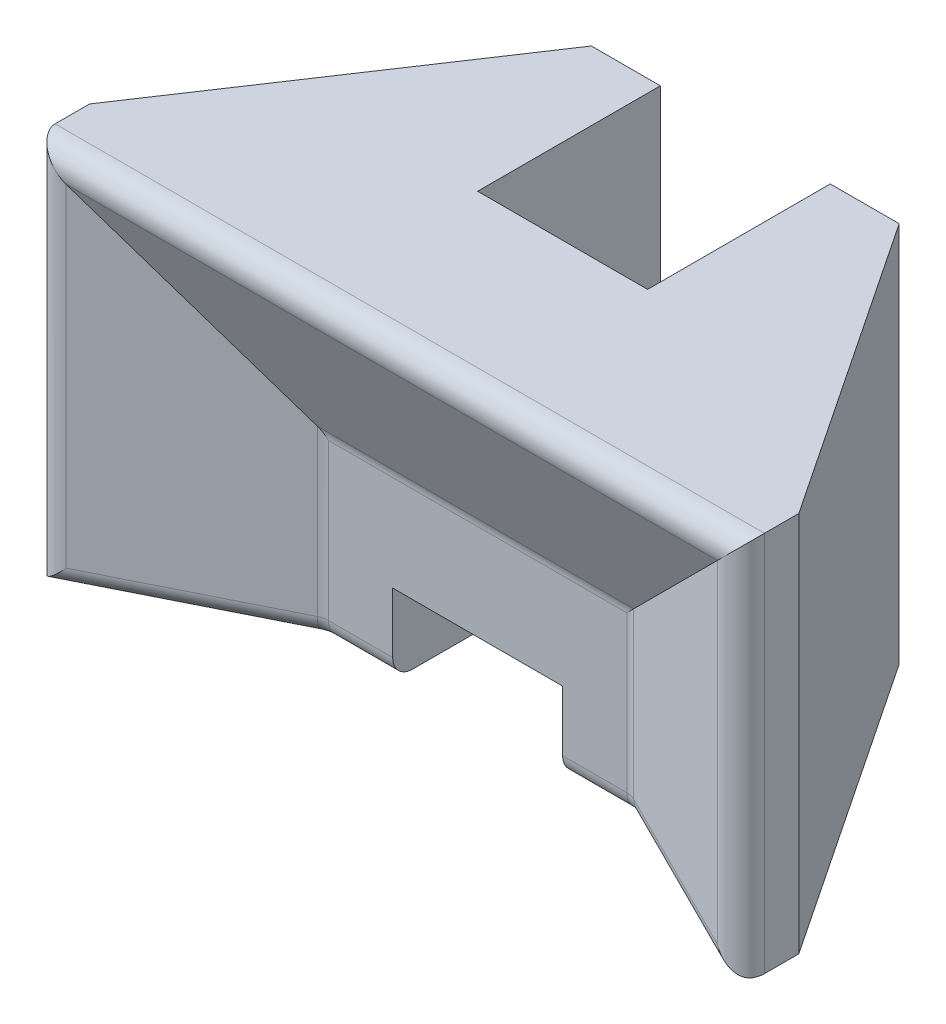
ISO-10303-21;
HEADER;
FILE_DESCRIPTION(('STEP AP214'),'2;1');
FILE_NAME('part.step','',(''),(''),'','','');
FILE_SCHEMA(('AUTOMOTIVE_DESIGN { 1 0 10303 214 1 1 1 1 }'));
ENDSEC;
DATA;
#1=APPLICATION_CONTEXT('core data for automotive mechanical design processes');
#2=APPLICATION_PROTOCOL_DEFINITION('international standard','automotive_design',2000,#1);
#3=PRODUCT_CONTEXT('',#1,'mechanical');
#4=PRODUCT('Part','Part','',(#3));
#5=PRODUCT_RELATED_PRODUCT_CATEGORY('part','',(#4));
#6=PRODUCT_DEFINITION_FORMATION('','',#4);
#7=PRODUCT_DEFINITION_CONTEXT('part definition',#1,'design');
#8=PRODUCT_DEFINITION('design','',#6,#7);
#9=PRODUCT_DEFINITION_SHAPE('','',#8);
#10=(LENGTH_UNIT() NAMED_UNIT(*) SI_UNIT(.MILLI.,.METRE.));
#11=(NAMED_UNIT(*) PLANE_ANGLE_UNIT() SI_UNIT($,.RADIAN.));
#12=(NAMED_UNIT(*) SI_UNIT($,.STERADIAN.) SOLID_ANGLE_UNIT());
#13=UNCERTAINTY_MEASURE_WITH_UNIT(LENGTH_MEASURE(1.E-05),#10,'distance_accuracy_value','');
#14=(GEOMETRIC_REPRESENTATION_CONTEXT(3) GLOBAL_UNCERTAINTY_ASSIGNED_CONTEXT((#13)) GLOBAL_UNIT_ASSIGNED_CONTEXT((#10,
#11,#12)) REPRESENTATION_CONTEXT('',''));
#15=CARTESIAN_POINT('',(0.,0.,0.));
#16=DIRECTION('',(0.,0.,1.));
#17=DIRECTION('',(1.,0.,0.));
#18=AXIS2_PLACEMENT_3D('',#15,#16,#17);
#19=CARTESIAN_POINT('',(-53.,-13.5,15.));
#20=DIRECTION('',(0.,1.,0.));
#21=DIRECTION('',(-1.,0.,0.));
#22=AXIS2_PLACEMENT_3D('',#19,#20,#21);
#23=PLANE('',#22);
#24=CARTESIAN_POINT('',(22.2917960675007,-13.5,3.));
#25=DIRECTION('',(0.,1.,0.));
#26=DIRECTION('',(-1.,0.,0.));
#27=AXIS2_PLACEMENT_3D('',#24,#25,#26);
#28=CIRCLE('',#27,6.);
#29=CARTESIAN_POINT('',(22.2917960675007,-13.5,-3.));
#30=VERTEX_POINT('',#29);
#31=CARTESIAN_POINT('',(24.9750776405004,-13.5,-2.36656314599951));
#32=VERTEX_POINT('',#31);
#33=EDGE_CURVE('E206',#30,#32,#28,.F.);
#34=ORIENTED_EDGE('',*,*,#33,.F.);
#35=DIRECTION('',(-1.,0.,0.));
#36=VECTOR('',#35,1.);
#37=CARTESIAN_POINT('',(-53.,-13.5,-3.));
#38=LINE('',#37,#36);
#39=CARTESIAN_POINT('',(12.7,-13.5,-3.));
#40=VERTEX_POINT('',#39);
#41=EDGE_CURVE('E208',#30,#40,#38,.T.);
#42=ORIENTED_EDGE('',*,*,#41,.T.);
#43=DIRECTION('',(0.,0.,-1.));
#44=VECTOR('',#43,1.);
#45=CARTESIAN_POINT('',(12.7,-13.5,0.));
#46=LINE('',#45,#44);
#47=CARTESIAN_POINT('',(12.7,-13.5,-40.));
#48=VERTEX_POINT('',#47);
#49=EDGE_CURVE('E297',#40,#48,#46,.T.);
#50=ORIENTED_EDGE('',*,*,#49,.T.);
#51=DIRECTION('',(-1.,0.,0.));
#52=VECTOR('',#51,1.);
#53=CARTESIAN_POINT('',(53.,-13.5,-40.));
#54=LINE('',#53,#52);
#55=CARTESIAN_POINT('',(22.9999999999999,-13.5,-40.));
#56=VERTEX_POINT('',#55);
#57=EDGE_CURVE('E336',#56,#48,#54,.T.);
#58=ORIENTED_EDGE('',*,*,#57,.F.);
#59=DIRECTION('',(0.554700196225228,0.,0.832050294337845));
#60=VECTOR('',#59,1.);
#61=CARTESIAN_POINT('',(22.9999999999999,-13.5,-40.));
#62=LINE('',#61,#60);
#63=CARTESIAN_POINT('',(53.,-13.5,5.00000000000026));
#64=VERTEX_POINT('',#63);
#65=EDGE_CURVE('E369',#56,#64,#62,.T.);
#66=ORIENTED_EDGE('',*,*,#65,.T.);
#67=DIRECTION('',(0.,0.,-1.));
#68=VECTOR('',#67,1.);
#69=CARTESIAN_POINT('',(53.,-13.5,15.));
#70=LINE('',#69,#68);
#71=CARTESIAN_POINT('',(53.,-13.5,10.1458980337502));
#72=VERTEX_POINT('',#71);
#73=EDGE_CURVE('E356',#72,#64,#70,.T.);
#74=ORIENTED_EDGE('',*,*,#73,.F.);
#75=CARTESIAN_POINT('',(50.,-13.5,10.1458980337502));
#76=DIRECTION('',(0.,1.,0.));
#77=DIRECTION('',(-1.,0.,0.));
#78=AXIS2_PLACEMENT_3D('',#75,#76,#77);
#79=CIRCLE('',#78,3.);
#80=CARTESIAN_POINT('',(52.6832815729998,-13.5,11.4875388202501));
#81=VERTEX_POINT('',#80);
#82=EDGE_CURVE('E452',#72,#81,#79,.F.);
#83=ORIENTED_EDGE('',*,*,#82,.T.);
#84=DIRECTION('',(0.894427190999917,0.,0.447213595499956));
#85=VECTOR('',#84,1.);
#86=CARTESIAN_POINT('',(24.3416407864999,-13.5,-2.68328157299978));
#87=LINE('',#86,#85);
#88=EDGE_CURVE('E211',#81,#32,#87,.F.);
#89=ORIENTED_EDGE('',*,*,#88,.T.);
#90=EDGE_LOOP('',(#34,#42,#50,#58,#66,#74,#83,#89));
#91=FACE_BOUND('',#90,.T.);
#92=ADVANCED_FACE('F45',(#91),#23,.F.);
#93=CARTESIAN_POINT('',(-53.,43.5,15.));
#94=DIRECTION('',(0.,-1.,0.));
#95=DIRECTION('',(0.,0.,-1.));
#96=AXIS2_PLACEMENT_3D('',#93,#94,#95);
#97=PLANE('',#96);
#98=DIRECTION('',(0.,0.,-1.));
#99=VECTOR('',#98,1.);
#100=CARTESIAN_POINT('',(-53.,43.5,15.));
#101=LINE('',#100,#99);
#102=CARTESIAN_POINT('',(-53.,43.5,10.1458980337502));
#103=VERTEX_POINT('',#102);
#104=CARTESIAN_POINT('',(-53.,43.5,5.00000000000026));
#105=VERTEX_POINT('',#104);
#106=EDGE_CURVE('E349',#103,#105,#101,.T.);
#107=ORIENTED_EDGE('',*,*,#106,.F.);
#108=DIRECTION('',(1.,0.,0.));
#109=VECTOR('',#108,1.);
#110=CARTESIAN_POINT('',(53.,43.5,10.1458980337502));
#111=LINE('',#110,#109);
#112=CARTESIAN_POINT('',(53.,43.5,10.1458980337502));
#113=VERTEX_POINT('',#112);
#114=EDGE_CURVE('E56',#103,#113,#111,.T.);
#115=ORIENTED_EDGE('',*,*,#114,.T.);
#116=DIRECTION('',(0.,0.,-1.));
#117=VECTOR('',#116,1.);
#118=CARTESIAN_POINT('',(53.,43.5,15.));
#119=LINE('',#118,#117);
#120=CARTESIAN_POINT('',(53.,43.5,5.00000000000026));
#121=VERTEX_POINT('',#120);
#122=EDGE_CURVE('E353',#113,#121,#119,.T.);
#123=ORIENTED_EDGE('',*,*,#122,.T.);
#124=DIRECTION('',(-0.554700196225228,0.,-0.832050294337844));
#125=VECTOR('',#124,1.);
#126=CARTESIAN_POINT('',(22.9999999999999,43.5,-40.));
#127=LINE('',#126,#125);
#128=CARTESIAN_POINT('',(22.9999999999999,43.5,-40.));
#129=VERTEX_POINT('',#128);
#130=EDGE_CURVE('E381',#121,#129,#127,.T.);
#131=ORIENTED_EDGE('',*,*,#130,.T.);
#132=DIRECTION('',(1.,0.,0.));
#133=VECTOR('',#132,1.);
#134=CARTESIAN_POINT('',(53.,43.5,-40.));
#135=LINE('',#134,#133);
#136=CARTESIAN_POINT('',(12.7,43.5,-40.));
#137=VERTEX_POINT('',#136);
#138=EDGE_CURVE('E340',#137,#129,#135,.T.);
#139=ORIENTED_EDGE('',*,*,#138,.F.);
#140=DIRECTION('',(0.,0.,-1.));
#141=VECTOR('',#140,1.);
#142=CARTESIAN_POINT('',(12.7,43.5,0.));
#143=LINE('',#142,#141);
#144=CARTESIAN_POINT('',(12.7,43.5,-12.7));
#145=VERTEX_POINT('',#144);
#146=EDGE_CURVE('E271',#145,#137,#143,.T.);
#147=ORIENTED_EDGE('',*,*,#146,.F.);
#148=DIRECTION('',(1.,0.,0.));
#149=VECTOR('',#148,1.);
#150=CARTESIAN_POINT('',(0.,43.5,-12.7));
#151=LINE('',#150,#149);
#152=CARTESIAN_POINT('',(-12.7,43.5,-12.7));
#153=VERTEX_POINT('',#152);
#154=EDGE_CURVE('E278',#153,#145,#151,.T.);
#155=ORIENTED_EDGE('',*,*,#154,.F.);
#156=DIRECTION('',(0.,0.,-1.));
#157=VECTOR('',#156,1.);
#158=CARTESIAN_POINT('',(-12.7,43.5,0.));
#159=LINE('',#158,#157);
#160=CARTESIAN_POINT('',(-12.7,43.5,-40.));
#161=VERTEX_POINT('',#160);
#162=EDGE_CURVE('E287',#153,#161,#159,.T.);
#163=ORIENTED_EDGE('',*,*,#162,.T.);
#164=CARTESIAN_POINT('',(-22.9999999999999,43.5,-40.));
#165=VERTEX_POINT('',#164);
#166=EDGE_CURVE('E341',#165,#161,#135,.T.);
#167=ORIENTED_EDGE('',*,*,#166,.F.);
#168=DIRECTION('',(-0.554700196225228,0.,0.832050294337844));
#169=VECTOR('',#168,1.);
#170=CARTESIAN_POINT('',(-22.9999999999999,43.5,-40.));
#171=LINE('',#170,#169);
#172=EDGE_CURVE('E377',#165,#105,#171,.T.);
#173=ORIENTED_EDGE('',*,*,#172,.T.);
#174=EDGE_LOOP('',(#107,#115,#123,#131,#139,#147,#155,#163,#167,#173));
#175=FACE_BOUND('',#174,.T.);
#176=ADVANCED_FACE('F509',(#175),#97,.F.);
#177=CARTESIAN_POINT('',(0.,0.,-40.));
#178=DIRECTION('',(0.,0.,-1.));
#179=DIRECTION('',(-1.,0.,0.));
#180=AXIS2_PLACEMENT_3D('',#177,#178,#179);
#181=PLANE('',#180);
#182=ORIENTED_EDGE('',*,*,#138,.T.);
#183=DIRECTION('',(0.,-1.,0.));
#184=VECTOR('',#183,1.);
#185=CARTESIAN_POINT('',(22.9999999999999,-13.5,-40.));
#186=LINE('',#185,#184);
#187=EDGE_CURVE('E359',#129,#56,#186,.T.);
#188=ORIENTED_EDGE('',*,*,#187,.T.);
#189=ORIENTED_EDGE('',*,*,#57,.T.);
#190=DIRECTION('',(0.,-1.,0.));
#191=VECTOR('',#190,1.);
#192=CARTESIAN_POINT('',(12.7,43.5,-40.));
#193=LINE('',#192,#191);
#194=EDGE_CURVE('E294',#137,#48,#193,.T.);
#195=ORIENTED_EDGE('',*,*,#194,.F.);
#196=EDGE_LOOP('',(#182,#188,#189,#195));
#197=FACE_BOUND('',#196,.T.);
#198=ADVANCED_FACE('F492',(#197),#181,.T.);
#199=DIRECTION('',(0.,0.,-1.));
#200=VECTOR('',#199,1.);
#201=CARTESIAN_POINT('',(-12.7,-13.5,0.));
#202=LINE('',#201,#200);
#203=CARTESIAN_POINT('',(-12.7,-13.5,-3.));
#204=VERTEX_POINT('',#203);
#205=CARTESIAN_POINT('',(-12.7,-13.5,-40.));
#206=VERTEX_POINT('',#205);
#207=EDGE_CURVE('E92',#204,#206,#202,.T.);
#208=ORIENTED_EDGE('',*,*,#207,.F.);
#209=DIRECTION('',(-1.,0.,0.));
#210=VECTOR('',#209,1.);
#211=CARTESIAN_POINT('',(-53.,-13.5,-3.));
#212=LINE('',#211,#210);
#213=CARTESIAN_POINT('',(-22.2917960675007,-13.5,-3.));
#214=VERTEX_POINT('',#213);
#215=EDGE_CURVE('E446',#204,#214,#212,.T.);
#216=ORIENTED_EDGE('',*,*,#215,.T.);
#217=CARTESIAN_POINT('',(-22.2917960675007,-13.5,3.));
#218=DIRECTION('',(0.,1.,0.));
#219=DIRECTION('',(-1.,0.,0.));
#220=AXIS2_PLACEMENT_3D('',#217,#218,#219);
#221=CIRCLE('',#220,6.);
#222=CARTESIAN_POINT('',(-24.9750776405004,-13.5,-2.3665631459995));
#223=VERTEX_POINT('',#222);
#224=EDGE_CURVE('E442',#223,#214,#221,.F.);
#225=ORIENTED_EDGE('',*,*,#224,.F.);
#226=DIRECTION('',(0.894427190999917,0.,-0.447213595499956));
#227=VECTOR('',#226,1.);
#228=CARTESIAN_POINT('',(-54.3416407864999,-13.5,12.3167184270002));
#229=LINE('',#228,#227);
#230=CARTESIAN_POINT('',(-52.6832815729997,-13.5,11.4875388202501));
#231=VERTEX_POINT('',#230);
#232=EDGE_CURVE('E439',#223,#231,#229,.F.);
#233=ORIENTED_EDGE('',*,*,#232,.T.);
#234=CARTESIAN_POINT('',(-50.,-13.5,10.1458980337502));
#235=DIRECTION('',(0.,1.,0.));
#236=DIRECTION('',(-1.,0.,0.));
#237=AXIS2_PLACEMENT_3D('',#234,#235,#236);
#238=CIRCLE('',#237,3.);
#239=CARTESIAN_POINT('',(-53.,-13.5,10.1458980337502));
#240=VERTEX_POINT('',#239);
#241=EDGE_CURVE('E436',#231,#240,#238,.F.);
#242=ORIENTED_EDGE('',*,*,#241,.T.);
#243=DIRECTION('',(0.,0.,-1.));
#244=VECTOR('',#243,1.);
#245=CARTESIAN_POINT('',(-53.,-13.5,15.));
#246=LINE('',#245,#244);
#247=CARTESIAN_POINT('',(-53.,-13.5,5.00000000000026));
#248=VERTEX_POINT('',#247);
#249=EDGE_CURVE('E346',#240,#248,#246,.T.);
#250=ORIENTED_EDGE('',*,*,#249,.T.);
#251=DIRECTION('',(0.554700196225228,0.,-0.832050294337845));
#252=VECTOR('',#251,1.);
#253=CARTESIAN_POINT('',(-22.9999999999999,-13.5,-40.));
#254=LINE('',#253,#252);
#255=CARTESIAN_POINT('',(-22.9999999999999,-13.5,-40.));
#256=VERTEX_POINT('',#255);
#257=EDGE_CURVE('E392',#248,#256,#254,.T.);
#258=ORIENTED_EDGE('',*,*,#257,.T.);
#259=EDGE_CURVE('E332',#206,#256,#54,.T.);
#260=ORIENTED_EDGE('',*,*,#259,.F.);
#261=EDGE_LOOP('',(#208,#216,#225,#233,#242,#250,#258,#260));
#262=FACE_BOUND('',#261,.T.);
#263=ADVANCED_FACE('F520',(#262),#23,.F.);
#264=CARTESIAN_POINT('',(0.,0.,0.));
#265=DIRECTION('',(0.,0.,-1.));
#266=DIRECTION('',(-1.,0.,0.));
#267=AXIS2_PLACEMENT_3D('',#264,#265,#266);
#268=PLANE('',#267);
#269=DIRECTION('',(0.,-1.,0.));
#270=VECTOR('',#269,1.);
#271=CARTESIAN_POINT('',(-22.2917960675007,0.,0.));
#272=LINE('',#271,#270);
#273=CARTESIAN_POINT('',(-22.2917960675007,12.7917960675007,0.));
#274=VERTEX_POINT('',#273);
#275=CARTESIAN_POINT('',(-22.2917960675007,-10.5,0.));
#276=VERTEX_POINT('',#275);
#277=EDGE_CURVE('E415',#274,#276,#272,.T.);
#278=ORIENTED_EDGE('',*,*,#277,.T.);
#279=DIRECTION('',(-1.,0.,0.));
#280=VECTOR('',#279,1.);
#281=CARTESIAN_POINT('',(0.,-10.5,0.));
#282=LINE('',#281,#280);
#283=CARTESIAN_POINT('',(-12.7,-10.5,0.));
#284=VERTEX_POINT('',#283);
#285=EDGE_CURVE('E418',#276,#284,#282,.F.);
#286=ORIENTED_EDGE('',*,*,#285,.T.);
#287=DIRECTION('',(0.,-1.,0.));
#288=VECTOR('',#287,1.);
#289=CARTESIAN_POINT('',(-12.7,-1.5,0.));
#290=LINE('',#289,#288);
#291=CARTESIAN_POINT('',(-12.7,-1.5,0.));
#292=VERTEX_POINT('',#291);
#293=EDGE_CURVE('E328',#292,#284,#290,.T.);
#294=ORIENTED_EDGE('',*,*,#293,.F.);
#295=DIRECTION('',(-1.,0.,0.));
#296=VECTOR('',#295,1.);
#297=CARTESIAN_POINT('',(0.,-1.5,0.));
#298=LINE('',#297,#296);
#299=CARTESIAN_POINT('',(12.7,-1.5,0.));
#300=VERTEX_POINT('',#299);
#301=EDGE_CURVE('E311',#300,#292,#298,.T.);
#302=ORIENTED_EDGE('',*,*,#301,.F.);
#303=DIRECTION('',(0.,-1.,0.));
#304=VECTOR('',#303,1.);
#305=CARTESIAN_POINT('',(12.7,-1.5,0.));
#306=LINE('',#305,#304);
#307=CARTESIAN_POINT('',(12.7,-10.5,0.));
#308=VERTEX_POINT('',#307);
#309=EDGE_CURVE('E323',#300,#308,#306,.T.);
#310=ORIENTED_EDGE('',*,*,#309,.T.);
#311=DIRECTION('',(-1.,0.,0.));
#312=VECTOR('',#311,1.);
#313=CARTESIAN_POINT('',(0.,-10.5,0.));
#314=LINE('',#313,#312);
#315=CARTESIAN_POINT('',(22.2917960675007,-10.5,0.));
#316=VERTEX_POINT('',#315);
#317=EDGE_CURVE('E405',#308,#316,#314,.F.);
#318=ORIENTED_EDGE('',*,*,#317,.T.);
#319=DIRECTION('',(0.,1.,0.));
#320=VECTOR('',#319,1.);
#321=CARTESIAN_POINT('',(22.2917960675007,0.,0.));
#322=LINE('',#321,#320);
#323=CARTESIAN_POINT('',(22.2917960675007,12.7917960675007,0.));
#324=VERTEX_POINT('',#323);
#325=EDGE_CURVE('E408',#316,#324,#322,.T.);
#326=ORIENTED_EDGE('',*,*,#325,.T.);
#327=DIRECTION('',(-1.,0.,0.));
#328=VECTOR('',#327,1.);
#329=CARTESIAN_POINT('',(0.,12.7917960675007,0.));
#330=LINE('',#329,#328);
#331=EDGE_CURVE('E412',#324,#274,#330,.T.);
#332=ORIENTED_EDGE('',*,*,#331,.T.);
#333=EDGE_LOOP('',(#278,#286,#294,#302,#310,#318,#326,#332));
#334=FACE_BOUND('',#333,.T.);
#335=ADVANCED_FACE('F484',(#334),#268,.F.);
#336=CARTESIAN_POINT('',(53.,-13.5,15.));
#337=DIRECTION('',(-1.,0.,0.));
#338=DIRECTION('',(0.,0.,1.));
#339=AXIS2_PLACEMENT_3D('',#336,#337,#338);
#340=PLANE('',#339);
#341=ORIENTED_EDGE('',*,*,#122,.F.);
#342=DIRECTION('',(0.,-1.,0.));
#343=VECTOR('',#342,1.);
#344=CARTESIAN_POINT('',(53.,-13.5,10.1458980337502));
#345=LINE('',#344,#343);
#346=EDGE_CURVE('E459',#113,#72,#345,.T.);
#347=ORIENTED_EDGE('',*,*,#346,.T.);
#348=ORIENTED_EDGE('',*,*,#73,.T.);
#349=DIRECTION('',(0.,1.,0.));
#350=VECTOR('',#349,1.);
#351=CARTESIAN_POINT('',(53.,43.5,5.00000000000027));
#352=LINE('',#351,#350);
#353=EDGE_CURVE('E373',#64,#121,#352,.T.);
#354=ORIENTED_EDGE('',*,*,#353,.T.);
#355=EDGE_LOOP('',(#341,#347,#348,#354));
#356=FACE_BOUND('',#355,.T.);
#357=ADVANCED_FACE('F510',(#356),#340,.F.);
#358=CARTESIAN_POINT('',(-53.,-13.5,15.));
#359=DIRECTION('',(1.,0.,0.));
#360=DIRECTION('',(0.,0.,-1.));
#361=AXIS2_PLACEMENT_3D('',#358,#359,#360);
#362=PLANE('',#361);
#363=ORIENTED_EDGE('',*,*,#249,.F.);
#364=DIRECTION('',(0.,1.,0.));
#365=VECTOR('',#364,1.);
#366=CARTESIAN_POINT('',(-53.,43.5,10.1458980337502));
#367=LINE('',#366,#365);
#368=EDGE_CURVE('E11',#240,#103,#367,.T.);
#369=ORIENTED_EDGE('',*,*,#368,.T.);
#370=ORIENTED_EDGE('',*,*,#106,.T.);
#371=DIRECTION('',(0.,-1.,0.));
#372=VECTOR('',#371,1.);
#373=CARTESIAN_POINT('',(-53.,-13.5,5.00000000000026));
#374=LINE('',#373,#372);
#375=EDGE_CURVE('E388',#105,#248,#374,.T.);
#376=ORIENTED_EDGE('',*,*,#375,.T.);
#377=EDGE_LOOP('',(#363,#369,#370,#376));
#378=FACE_BOUND('',#377,.T.);
#379=ADVANCED_FACE('F512',(#378),#362,.F.);
#380=CARTESIAN_POINT('',(-53.0000000000002,0.,15.));
#381=DIRECTION('',(-0.447213595499956,0.,-0.894427190999917));
#382=DIRECTION('',(0.,1.,0.));
#383=AXIS2_PLACEMENT_3D('',#380,#381,#382);
#384=PLANE('',#383);
#385=DIRECTION('',(-0.894427190999917,0.,0.447213595499956));
#386=VECTOR('',#385,1.);
#387=CARTESIAN_POINT('',(-23.,-10.5,0.));
#388=LINE('',#387,#386);
#389=CARTESIAN_POINT('',(-48.6583592135001,-10.5,12.82917960675));
#390=VERTEX_POINT('',#389);
#391=CARTESIAN_POINT('',(-23.6334368540006,-10.5,0.316718427000248));
#392=VERTEX_POINT('',#391);
#393=EDGE_CURVE('E430',#390,#392,#388,.F.);
#394=ORIENTED_EDGE('',*,*,#393,.T.);
#395=DIRECTION('',(0.,1.,0.));
#396=VECTOR('',#395,1.);
#397=CARTESIAN_POINT('',(-23.6334368540006,0.,0.31671842700025));
#398=LINE('',#397,#396);
#399=CARTESIAN_POINT('',(-23.6334368540006,14.1334368540006,0.316718427000248));
#400=VERTEX_POINT('',#399);
#401=EDGE_CURVE('E433',#392,#400,#398,.T.);
#402=ORIENTED_EDGE('',*,*,#401,.T.);
#403=DIRECTION('',(-0.666666666666667,0.666666666666667,0.333333333333332));
#404=VECTOR('',#403,1.);
#405=CARTESIAN_POINT('',(-29.4444444444445,19.9444444444445,3.22222222222222));
#406=LINE('',#405,#404);
#407=CARTESIAN_POINT('',(-48.6583592135001,39.1583592135001,12.82917960675));
#408=VERTEX_POINT('',#407);
#409=EDGE_CURVE('E350',#408,#400,#406,.F.);
#410=ORIENTED_EDGE('',*,*,#409,.F.);
#411=DIRECTION('',(0.,-1.,0.));
#412=VECTOR('',#411,1.);
#413=CARTESIAN_POINT('',(-48.6583592135001,-13.5,12.82917960675));
#414=LINE('',#413,#412);
#415=EDGE_CURVE('E427',#408,#390,#414,.T.);
#416=ORIENTED_EDGE('',*,*,#415,.T.);
#417=EDGE_LOOP('',(#394,#402,#410,#416));
#418=FACE_BOUND('',#417,.T.);
#419=ADVANCED_FACE('F518',(#418),#384,.F.);
#420=CARTESIAN_POINT('',(0.,43.5000000000002,15.));
#421=DIRECTION('',(0.,0.447213595499956,-0.894427190999917));
#422=DIRECTION('',(1.,0.,0.));
#423=AXIS2_PLACEMENT_3D('',#420,#421,#422);
#424=PLANE('',#423);
#425=ORIENTED_EDGE('',*,*,#409,.T.);
#426=DIRECTION('',(1.,0.,0.));
#427=VECTOR('',#426,1.);
#428=CARTESIAN_POINT('',(0.,14.1334368540006,0.316718427000248));
#429=LINE('',#428,#427);
#430=CARTESIAN_POINT('',(23.6334368540006,14.1334368540006,0.316718427000251));
#431=VERTEX_POINT('',#430);
#432=EDGE_CURVE('E424',#400,#431,#429,.T.);
#433=ORIENTED_EDGE('',*,*,#432,.T.);
#434=DIRECTION('',(0.666666666666667,0.666666666666667,0.333333333333332));
#435=VECTOR('',#434,1.);
#436=CARTESIAN_POINT('',(33.6666666666668,24.1666666666668,5.33333333333333));
#437=LINE('',#436,#435);
#438=CARTESIAN_POINT('',(48.6583592135001,39.1583592135001,12.82917960675));
#439=VERTEX_POINT('',#438);
#440=EDGE_CURVE('E345',#439,#431,#437,.F.);
#441=ORIENTED_EDGE('',*,*,#440,.F.);
#442=DIRECTION('',(-1.,0.,0.));
#443=VECTOR('',#442,1.);
#444=CARTESIAN_POINT('',(-53.,39.1583592135001,12.82917960675));
#445=LINE('',#444,#443);
#446=EDGE_CURVE('E421',#439,#408,#445,.T.);
#447=ORIENTED_EDGE('',*,*,#446,.T.);
#448=EDGE_LOOP('',(#425,#433,#441,#447));
#449=FACE_BOUND('',#448,.T.);
#450=ADVANCED_FACE('F555',(#449),#424,.F.);
#451=CARTESIAN_POINT('',(53.0000000000002,0.,15.));
#452=DIRECTION('',(0.447213595499956,0.,-0.894427190999917));
#453=DIRECTION('',(0.,-1.,0.));
#454=AXIS2_PLACEMENT_3D('',#451,#452,#453);
#455=PLANE('',#454);
#456=ORIENTED_EDGE('',*,*,#440,.T.);
#457=DIRECTION('',(0.,-1.,0.));
#458=VECTOR('',#457,1.);
#459=CARTESIAN_POINT('',(23.6334368540006,0.,0.316718427000248));
#460=LINE('',#459,#458);
#461=CARTESIAN_POINT('',(23.6334368540006,-10.5,0.316718427000247));
#462=VERTEX_POINT('',#461);
#463=EDGE_CURVE('E401',#431,#462,#460,.T.);
#464=ORIENTED_EDGE('',*,*,#463,.T.);
#465=DIRECTION('',(-0.894427190999917,0.,-0.447213595499956));
#466=VECTOR('',#465,1.);
#467=CARTESIAN_POINT('',(53.0000000000001,-10.5,14.9999999999999));
#468=LINE('',#467,#466);
#469=CARTESIAN_POINT('',(48.6583592135001,-10.5,12.82917960675));
#470=VERTEX_POINT('',#469);
#471=EDGE_CURVE('E398',#462,#470,#468,.F.);
#472=ORIENTED_EDGE('',*,*,#471,.T.);
#473=DIRECTION('',(0.,1.,0.));
#474=VECTOR('',#473,1.);
#475=CARTESIAN_POINT('',(48.6583592135001,43.5,12.82917960675));
#476=LINE('',#475,#474);
#477=EDGE_CURVE('E395',#470,#439,#476,.T.);
#478=ORIENTED_EDGE('',*,*,#477,.T.);
#479=EDGE_LOOP('',(#456,#464,#472,#478));
#480=FACE_BOUND('',#479,.T.);
#481=ADVANCED_FACE('F473',(#480),#455,.F.);
#482=ORIENTED_EDGE('',*,*,#259,.T.);
#483=DIRECTION('',(0.,1.,0.));
#484=VECTOR('',#483,1.);
#485=CARTESIAN_POINT('',(-22.9999999999999,43.5,-40.));
#486=LINE('',#485,#484);
#487=EDGE_CURVE('E384',#256,#165,#486,.T.);
#488=ORIENTED_EDGE('',*,*,#487,.T.);
#489=ORIENTED_EDGE('',*,*,#166,.T.);
#490=DIRECTION('',(0.,-1.,0.));
#491=VECTOR('',#490,1.);
#492=CARTESIAN_POINT('',(-12.7,43.5,-40.));
#493=LINE('',#492,#491);
#494=EDGE_CURVE('E298',#161,#206,#493,.T.);
#495=ORIENTED_EDGE('',*,*,#494,.T.);
#496=EDGE_LOOP('',(#482,#488,#489,#495));
#497=FACE_BOUND('',#496,.T.);
#498=ADVANCED_FACE('F535',(#497),#181,.T.);
#499=CARTESIAN_POINT('',(12.7,-1.5,0.));
#500=DIRECTION('',(-1.,0.,0.));
#501=DIRECTION('',(0.,0.,1.));
#502=AXIS2_PLACEMENT_3D('',#499,#500,#501);
#503=PLANE('',#502);
#504=ORIENTED_EDGE('',*,*,#49,.F.);
#505=CARTESIAN_POINT('',(12.7,-10.5,-3.));
#506=DIRECTION('',(-1.,0.,0.));
#507=DIRECTION('',(0.,0.,1.));
#508=AXIS2_PLACEMENT_3D('',#505,#506,#507);
#509=CIRCLE('',#508,3.);
#510=EDGE_CURVE('E225',#40,#308,#509,.T.);
#511=ORIENTED_EDGE('',*,*,#510,.T.);
#512=ORIENTED_EDGE('',*,*,#309,.F.);
#513=DIRECTION('',(0.,0.,-1.));
#514=VECTOR('',#513,1.);
#515=CARTESIAN_POINT('',(12.7,-1.5,0.));
#516=LINE('',#515,#514);
#517=CARTESIAN_POINT('',(12.7,-1.5,-12.7));
#518=VERTEX_POINT('',#517);
#519=EDGE_CURVE('E307',#300,#518,#516,.T.);
#520=ORIENTED_EDGE('',*,*,#519,.T.);
#521=DIRECTION('',(0.,-1.,0.));
#522=VECTOR('',#521,1.);
#523=CARTESIAN_POINT('',(12.7,43.5,-12.7));
#524=LINE('',#523,#522);
#525=EDGE_CURVE('E293',#145,#518,#524,.T.);
#526=ORIENTED_EDGE('',*,*,#525,.F.);
#527=ORIENTED_EDGE('',*,*,#146,.T.);
#528=ORIENTED_EDGE('',*,*,#194,.T.);
#529=EDGE_LOOP('',(#504,#511,#512,#520,#526,#527,#528));
#530=FACE_BOUND('',#529,.T.);
#531=ADVANCED_FACE('F488',(#530),#503,.T.);
#532=CARTESIAN_POINT('',(-12.7,-1.5,0.));
#533=DIRECTION('',(-1.,0.,0.));
#534=DIRECTION('',(0.,0.,1.));
#535=AXIS2_PLACEMENT_3D('',#532,#533,#534);
#536=PLANE('',#535);
#537=ORIENTED_EDGE('',*,*,#293,.T.);
#538=CARTESIAN_POINT('',(-12.7,-10.5,-3.));
#539=DIRECTION('',(-1.,0.,0.));
#540=DIRECTION('',(0.,0.,1.));
#541=AXIS2_PLACEMENT_3D('',#538,#539,#540);
#542=CIRCLE('',#541,3.);
#543=EDGE_CURVE('E449',#284,#204,#542,.F.);
#544=ORIENTED_EDGE('',*,*,#543,.T.);
#545=ORIENTED_EDGE('',*,*,#207,.T.);
#546=ORIENTED_EDGE('',*,*,#494,.F.);
#547=ORIENTED_EDGE('',*,*,#162,.F.);
#548=DIRECTION('',(0.,-1.,0.));
#549=VECTOR('',#548,1.);
#550=CARTESIAN_POINT('',(-12.7,43.5,-12.7));
#551=LINE('',#550,#549);
#552=CARTESIAN_POINT('',(-12.7,-1.5,-12.7));
#553=VERTEX_POINT('',#552);
#554=EDGE_CURVE('E301',#153,#553,#551,.T.);
#555=ORIENTED_EDGE('',*,*,#554,.T.);
#556=DIRECTION('',(0.,0.,-1.));
#557=VECTOR('',#556,1.);
#558=CARTESIAN_POINT('',(-12.7,-1.5,0.));
#559=LINE('',#558,#557);
#560=EDGE_CURVE('E315',#292,#553,#559,.T.);
#561=ORIENTED_EDGE('',*,*,#560,.F.);
#562=EDGE_LOOP('',(#537,#544,#545,#546,#547,#555,#561));
#563=FACE_BOUND('',#562,.T.);
#564=ADVANCED_FACE('F618',(#563),#536,.F.);
#565=CARTESIAN_POINT('',(0.,-1.5,0.));
#566=DIRECTION('',(0.,-1.,0.));
#567=DIRECTION('',(0.,0.,-1.));
#568=AXIS2_PLACEMENT_3D('',#565,#566,#567);
#569=PLANE('',#568);
#570=ORIENTED_EDGE('',*,*,#519,.F.);
#571=ORIENTED_EDGE('',*,*,#301,.T.);
#572=ORIENTED_EDGE('',*,*,#560,.T.);
#573=DIRECTION('',(1.,0.,0.));
#574=VECTOR('',#573,1.);
#575=CARTESIAN_POINT('',(0.,-1.5,-12.7));
#576=LINE('',#575,#574);
#577=EDGE_CURVE('E319',#553,#518,#576,.T.);
#578=ORIENTED_EDGE('',*,*,#577,.T.);
#579=EDGE_LOOP('',(#570,#571,#572,#578));
#580=FACE_BOUND('',#579,.T.);
#581=ADVANCED_FACE('F626',(#580),#569,.T.);
#582=CARTESIAN_POINT('',(0.,43.5,-12.7));
#583=DIRECTION('',(0.,0.,-1.));
#584=DIRECTION('',(-1.,0.,0.));
#585=AXIS2_PLACEMENT_3D('',#582,#583,#584);
#586=PLANE('',#585);
#587=ORIENTED_EDGE('',*,*,#554,.F.);
#588=ORIENTED_EDGE('',*,*,#154,.T.);
#589=ORIENTED_EDGE('',*,*,#525,.T.);
#590=ORIENTED_EDGE('',*,*,#577,.F.);
#591=EDGE_LOOP('',(#587,#588,#589,#590));
#592=FACE_BOUND('',#591,.T.);
#593=ADVANCED_FACE('F578',(#592),#586,.T.);
#594=CARTESIAN_POINT('',(22.9999999999999,0.,-40.));
#595=DIRECTION('',(0.832050294337844,0.,-0.554700196225228));
#596=DIRECTION('',(0.,1.,0.));
#597=AXIS2_PLACEMENT_3D('',#594,#595,#596);
#598=PLANE('',#597);
#599=ORIENTED_EDGE('',*,*,#130,.F.);
#600=ORIENTED_EDGE('',*,*,#353,.F.);
#601=ORIENTED_EDGE('',*,*,#65,.F.);
#602=ORIENTED_EDGE('',*,*,#187,.F.);
#603=EDGE_LOOP('',(#599,#600,#601,#602));
#604=FACE_BOUND('',#603,.T.);
#605=ADVANCED_FACE('F497',(#604),#598,.T.);
#606=CARTESIAN_POINT('',(-22.9999999999999,0.,-40.));
#607=DIRECTION('',(-0.832050294337844,0.,-0.554700196225228));
#608=DIRECTION('',(0.,-1.,0.));
#609=AXIS2_PLACEMENT_3D('',#606,#607,#608);
#610=PLANE('',#609);
#611=ORIENTED_EDGE('',*,*,#257,.F.);
#612=ORIENTED_EDGE('',*,*,#375,.F.);
#613=ORIENTED_EDGE('',*,*,#172,.F.);
#614=ORIENTED_EDGE('',*,*,#487,.F.);
#615=EDGE_LOOP('',(#611,#612,#613,#614));
#616=FACE_BOUND('',#615,.T.);
#617=ADVANCED_FACE('F577',(#616),#610,.T.);
#618=CARTESIAN_POINT('',(-50.,0.,10.1458980337502));
#619=DIRECTION('',(0.,-1.,0.));
#620=DIRECTION('',(0.,0.,-1.));
#621=AXIS2_PLACEMENT_3D('',#618,#619,#620);
#622=CYLINDRICAL_SURFACE('',#621,3.);
#623=ORIENTED_EDGE('',*,*,#368,.F.);
#624=ORIENTED_EDGE('',*,*,#241,.F.);
#625=CARTESIAN_POINT('',(-50.,-10.5,10.1458980337502));
#626=DIRECTION('',(0.632455532033677,-0.707106781186547,-0.316227766016837));
#627=DIRECTION('',(-0.632455532033677,-0.707106781186547,0.316227766016837));
#628=AXIS2_PLACEMENT_3D('',#625,#626,#627);
#629=ELLIPSE('',#628,4.24264068711928,3.);
#630=EDGE_CURVE('E49',#390,#231,#629,.T.);
#631=ORIENTED_EDGE('',*,*,#630,.F.);
#632=ORIENTED_EDGE('',*,*,#415,.F.);
#633=CARTESIAN_POINT('',(-50.,40.5,10.1458980337502));
#634=DIRECTION('',(-0.707106781186547,-0.707106781186547,0.));
#635=DIRECTION('',(-0.707106781186547,0.707106781186547,0.));
#636=AXIS2_PLACEMENT_3D('',#633,#634,#635);
#637=ELLIPSE('',#636,4.24264068711928,3.);
#638=CARTESIAN_POINT('',(-50.,40.5,13.1458980337502));
#639=VERTEX_POINT('',#638);
#640=EDGE_CURVE('E83',#639,#408,#637,.F.);
#641=ORIENTED_EDGE('',*,*,#640,.F.);
#642=CARTESIAN_POINT('',(-50.,40.5,10.1458980337502));
#643=DIRECTION('',(-0.707106781186547,-0.707106781186547,0.));
#644=DIRECTION('',(0.707106781186547,-0.707106781186547,0.));
#645=AXIS2_PLACEMENT_3D('',#642,#643,#644);
#646=ELLIPSE('',#645,4.24264068711928,3.);
#647=EDGE_CURVE('E266',#103,#639,#646,.F.);
#648=ORIENTED_EDGE('',*,*,#647,.F.);
#649=EDGE_LOOP('',(#623,#624,#631,#632,#641,#648));
#650=FACE_BOUND('',#649,.T.);
#651=ADVANCED_FACE('F47',(#650),#622,.T.);
#652=CARTESIAN_POINT('',(-53.,-10.5,-3.));
#653=DIRECTION('',(-1.,0.,0.));
#654=DIRECTION('',(0.,-1.,0.));
#655=AXIS2_PLACEMENT_3D('',#652,#653,#654);
#656=CYLINDRICAL_SURFACE('',#655,3.);
#657=ORIENTED_EDGE('',*,*,#543,.F.);
#658=ORIENTED_EDGE('',*,*,#285,.F.);
#659=CARTESIAN_POINT('',(-22.2917960675007,-10.5,-3.));
#660=DIRECTION('',(-1.,0.,0.));
#661=DIRECTION('',(0.,0.,1.));
#662=AXIS2_PLACEMENT_3D('',#659,#660,#661);
#663=CIRCLE('',#662,3.);
#664=EDGE_CURVE('E262',#214,#276,#663,.T.);
#665=ORIENTED_EDGE('',*,*,#664,.F.);
#666=ORIENTED_EDGE('',*,*,#215,.F.);
#667=EDGE_LOOP('',(#657,#658,#665,#666));
#668=FACE_BOUND('',#667,.T.);
#669=ADVANCED_FACE('F542',(#668),#656,.T.);
#670=CARTESIAN_POINT('',(-54.3416407864999,-10.5,12.3167184270002));
#671=DIRECTION('',(-0.894427190999917,0.,0.447213595499956));
#672=DIRECTION('',(0.447213595499956,0.,0.894427190999917));
#673=AXIS2_PLACEMENT_3D('',#670,#671,#672);
#674=CYLINDRICAL_SURFACE('',#673,3.);
#675=ORIENTED_EDGE('',*,*,#630,.T.);
#676=ORIENTED_EDGE('',*,*,#232,.F.);
#677=CARTESIAN_POINT('',(-24.9750776405004,-10.5,-2.3665631459995));
#678=DIRECTION('',(0.894427190999917,0.,-0.447213595499957));
#679=DIRECTION('',(-0.447213595499957,0.,-0.894427190999917));
#680=AXIS2_PLACEMENT_3D('',#677,#678,#679);
#681=CIRCLE('',#680,3.);
#682=EDGE_CURVE('E258',#392,#223,#681,.T.);
#683=ORIENTED_EDGE('',*,*,#682,.F.);
#684=ORIENTED_EDGE('',*,*,#393,.F.);
#685=EDGE_LOOP('',(#675,#676,#683,#684));
#686=FACE_BOUND('',#685,.T.);
#687=ADVANCED_FACE('F549',(#686),#674,.T.);
#688=CARTESIAN_POINT('',(0.,40.5,10.1458980337502));
#689=DIRECTION('',(-1.,0.,0.));
#690=DIRECTION('',(0.,0.,1.));
#691=AXIS2_PLACEMENT_3D('',#688,#689,#690);
#692=CYLINDRICAL_SURFACE('',#691,3.);
#693=ORIENTED_EDGE('',*,*,#640,.T.);
#694=ORIENTED_EDGE('',*,*,#446,.F.);
#695=CARTESIAN_POINT('',(50.,40.5,10.1458980337502));
#696=DIRECTION('',(-0.707106781186547,0.707106781186547,0.));
#697=DIRECTION('',(0.707106781186547,0.707106781186547,0.));
#698=AXIS2_PLACEMENT_3D('',#695,#696,#697);
#699=ELLIPSE('',#698,4.24264068711928,3.);
#700=CARTESIAN_POINT('',(50.,40.5,13.1458980337502));
#701=VERTEX_POINT('',#700);
#702=EDGE_CURVE('E75',#701,#439,#699,.F.);
#703=ORIENTED_EDGE('',*,*,#702,.F.);
#704=CARTESIAN_POINT('',(50.,40.5,10.1458980337502));
#705=DIRECTION('',(-0.707106781186547,0.707106781186547,0.));
#706=DIRECTION('',(-0.707106781186547,-0.707106781186547,0.));
#707=AXIS2_PLACEMENT_3D('',#704,#705,#706);
#708=ELLIPSE('',#707,4.24264068711928,3.);
#709=EDGE_CURVE('E253',#113,#701,#708,.F.);
#710=ORIENTED_EDGE('',*,*,#709,.F.);
#711=ORIENTED_EDGE('',*,*,#114,.F.);
#712=ORIENTED_EDGE('',*,*,#647,.T.);
#713=EDGE_LOOP('',(#693,#694,#703,#710,#711,#712));
#714=FACE_BOUND('',#713,.T.);
#715=ADVANCED_FACE('F506',(#714),#692,.T.);
#716=CARTESIAN_POINT('',(-22.2917960675007,-10.5,3.));
#717=DIRECTION('',(0.,1.,0.));
#718=DIRECTION('',(-1.,0.,0.));
#719=AXIS2_PLACEMENT_3D('',#716,#717,#718);
#720=TOROIDAL_SURFACE('',#719,6.,3.);
#721=ORIENTED_EDGE('',*,*,#224,.T.);
#722=ORIENTED_EDGE('',*,*,#664,.T.);
#723=CARTESIAN_POINT('',(-22.2917960675007,-10.5,3.));
#724=DIRECTION('',(0.,1.,0.));
#725=DIRECTION('',(-1.,0.,0.));
#726=AXIS2_PLACEMENT_3D('',#723,#724,#725);
#727=CIRCLE('',#726,3.);
#728=EDGE_CURVE('E249',#392,#276,#727,.F.);
#729=ORIENTED_EDGE('',*,*,#728,.F.);
#730=ORIENTED_EDGE('',*,*,#682,.T.);
#731=EDGE_LOOP('',(#721,#722,#729,#730));
#732=FACE_BOUND('',#731,.T.);
#733=ADVANCED_FACE('F546',(#732),#720,.T.);
#734=CARTESIAN_POINT('',(50.,0.,10.1458980337502));
#735=DIRECTION('',(0.,1.,0.));
#736=DIRECTION('',(0.,0.,1.));
#737=AXIS2_PLACEMENT_3D('',#734,#735,#736);
#738=CYLINDRICAL_SURFACE('',#737,3.);
#739=ORIENTED_EDGE('',*,*,#702,.T.);
#740=ORIENTED_EDGE('',*,*,#477,.F.);
#741=CARTESIAN_POINT('',(50.,-10.5,10.1458980337502));
#742=DIRECTION('',(0.632455532033677,0.707106781186547,0.316227766016837));
#743=DIRECTION('',(-0.632455532033677,0.707106781186547,-0.316227766016837));
#744=AXIS2_PLACEMENT_3D('',#741,#742,#743);
#745=ELLIPSE('',#744,4.24264068711928,3.);
#746=EDGE_CURVE('E245',#81,#470,#745,.F.);
#747=ORIENTED_EDGE('',*,*,#746,.F.);
#748=ORIENTED_EDGE('',*,*,#82,.F.);
#749=ORIENTED_EDGE('',*,*,#346,.F.);
#750=ORIENTED_EDGE('',*,*,#709,.T.);
#751=EDGE_LOOP('',(#739,#740,#747,#748,#749,#750));
#752=FACE_BOUND('',#751,.T.);
#753=ADVANCED_FACE('F504',(#752),#738,.T.);
#754=CARTESIAN_POINT('',(-22.2917960675007,0.,3.));
#755=DIRECTION('',(0.,-1.,0.));
#756=DIRECTION('',(0.,0.,-1.));
#757=AXIS2_PLACEMENT_3D('',#754,#755,#756);
#758=CYLINDRICAL_SURFACE('',#757,3.);
#759=ORIENTED_EDGE('',*,*,#728,.T.);
#760=ORIENTED_EDGE('',*,*,#277,.F.);
#761=CARTESIAN_POINT('',(-22.2917960675007,12.7917960675007,3.));
#762=DIRECTION('',(-0.707106781186547,-0.707106781186547,0.));
#763=DIRECTION('',(-0.707106781186547,0.707106781186547,0.));
#764=AXIS2_PLACEMENT_3D('',#761,#762,#763);
#765=ELLIPSE('',#764,4.24264068711928,3.);
#766=EDGE_CURVE('E237',#400,#274,#765,.T.);
#767=ORIENTED_EDGE('',*,*,#766,.F.);
#768=ORIENTED_EDGE('',*,*,#401,.F.);
#769=EDGE_LOOP('',(#759,#760,#767,#768));
#770=FACE_BOUND('',#769,.T.);
#771=ADVANCED_FACE('F552',(#770),#758,.F.);
#772=CARTESIAN_POINT('',(-30.4583592135002,-10.5,-30.0832815729997));
#773=DIRECTION('',(-0.894427190999917,0.,-0.447213595499956));
#774=DIRECTION('',(-0.447213595499956,0.,0.894427190999917));
#775=AXIS2_PLACEMENT_3D('',#772,#773,#774);
#776=CYLINDRICAL_SURFACE('',#775,3.);
#777=ORIENTED_EDGE('',*,*,#746,.T.);
#778=ORIENTED_EDGE('',*,*,#471,.F.);
#779=CARTESIAN_POINT('',(24.9750776405004,-10.5,-2.36656314599951));
#780=DIRECTION('',(-0.894427190999917,0.,-0.447213595499956));
#781=DIRECTION('',(-0.447213595499956,0.,0.894427190999917));
#782=AXIS2_PLACEMENT_3D('',#779,#780,#781);
#783=CIRCLE('',#782,3.);
#784=EDGE_CURVE('E232',#32,#462,#783,.T.);
#785=ORIENTED_EDGE('',*,*,#784,.F.);
#786=ORIENTED_EDGE('',*,*,#88,.F.);
#787=EDGE_LOOP('',(#777,#778,#785,#786));
#788=FACE_BOUND('',#787,.T.);
#789=ADVANCED_FACE('F469',(#788),#776,.T.);
#790=CARTESIAN_POINT('',(-53.,-10.5,-3.));
#791=DIRECTION('',(-1.,0.,0.));
#792=DIRECTION('',(0.,-1.,0.));
#793=AXIS2_PLACEMENT_3D('',#790,#791,#792);
#794=CYLINDRICAL_SURFACE('',#793,3.);
#795=ORIENTED_EDGE('',*,*,#510,.F.);
#796=ORIENTED_EDGE('',*,*,#41,.F.);
#797=CARTESIAN_POINT('',(22.2917960675007,-10.5,-3.));
#798=DIRECTION('',(1.,0.,0.));
#799=DIRECTION('',(0.,0.,-1.));
#800=AXIS2_PLACEMENT_3D('',#797,#798,#799);
#801=CIRCLE('',#800,3.);
#802=EDGE_CURVE('E223',#316,#30,#801,.T.);
#803=ORIENTED_EDGE('',*,*,#802,.F.);
#804=ORIENTED_EDGE('',*,*,#317,.F.);
#805=EDGE_LOOP('',(#795,#796,#803,#804));
#806=FACE_BOUND('',#805,.T.);
#807=ADVANCED_FACE('F221',(#806),#794,.T.);
#808=CARTESIAN_POINT('',(0.,12.7917960675007,3.));
#809=DIRECTION('',(-1.,0.,0.));
#810=DIRECTION('',(0.,0.,1.));
#811=AXIS2_PLACEMENT_3D('',#808,#809,#810);
#812=CYLINDRICAL_SURFACE('',#811,3.);
#813=ORIENTED_EDGE('',*,*,#766,.T.);
#814=ORIENTED_EDGE('',*,*,#331,.F.);
#815=CARTESIAN_POINT('',(22.2917960675007,12.7917960675007,3.));
#816=DIRECTION('',(-0.707106781186547,0.707106781186547,0.));
#817=DIRECTION('',(0.707106781186547,0.707106781186547,0.));
#818=AXIS2_PLACEMENT_3D('',#815,#816,#817);
#819=ELLIPSE('',#818,4.24264068711928,3.);
#820=EDGE_CURVE('E233',#431,#324,#819,.T.);
#821=ORIENTED_EDGE('',*,*,#820,.F.);
#822=ORIENTED_EDGE('',*,*,#432,.F.);
#823=EDGE_LOOP('',(#813,#814,#821,#822));
#824=FACE_BOUND('',#823,.T.);
#825=ADVANCED_FACE('F480',(#824),#812,.F.);
#826=CARTESIAN_POINT('',(22.2917960675007,-10.5,3.));
#827=DIRECTION('',(0.,1.,0.));
#828=DIRECTION('',(-1.,0.,0.));
#829=AXIS2_PLACEMENT_3D('',#826,#827,#828);
#830=TOROIDAL_SURFACE('',#829,6.,3.);
#831=ORIENTED_EDGE('',*,*,#33,.T.);
#832=ORIENTED_EDGE('',*,*,#784,.T.);
#833=CARTESIAN_POINT('',(22.2917960675007,-10.5,3.));
#834=DIRECTION('',(0.,1.,0.));
#835=DIRECTION('',(-1.,0.,0.));
#836=AXIS2_PLACEMENT_3D('',#833,#834,#835);
#837=CIRCLE('',#836,3.);
#838=EDGE_CURVE('E230',#316,#462,#837,.F.);
#839=ORIENTED_EDGE('',*,*,#838,.F.);
#840=ORIENTED_EDGE('',*,*,#802,.T.);
#841=EDGE_LOOP('',(#831,#832,#839,#840));
#842=FACE_BOUND('',#841,.T.);
#843=ADVANCED_FACE('F229',(#842),#830,.T.);
#844=CARTESIAN_POINT('',(22.2917960675007,0.,3.));
#845=DIRECTION('',(0.,1.,0.));
#846=DIRECTION('',(0.,0.,1.));
#847=AXIS2_PLACEMENT_3D('',#844,#845,#846);
#848=CYLINDRICAL_SURFACE('',#847,3.);
#849=ORIENTED_EDGE('',*,*,#820,.T.);
#850=ORIENTED_EDGE('',*,*,#325,.F.);
#851=ORIENTED_EDGE('',*,*,#838,.T.);
#852=ORIENTED_EDGE('',*,*,#463,.F.);
#853=EDGE_LOOP('',(#849,#850,#851,#852));
#854=FACE_BOUND('',#853,.T.);
#855=ADVANCED_FACE('F466',(#854),#848,.F.);
#856=CLOSED_SHELL('',(#92,#176,#198,#263,#335,#357,#379,#419,#450,#481,#498,#531,#564,#581,#593,
#605,#617,#651,#669,#687,#715,#733,#753,#771,#789,#807,#825,#843,#855));
#857=MANIFOLD_SOLID_BREP('B2',#856);
#858=ADVANCED_BREP_SHAPE_REPRESENTATION('',(#18,#857),#14);
#859=SHAPE_DEFINITION_REPRESENTATION(#9,#858);
ENDSEC;
END-ISO-10303-21;
